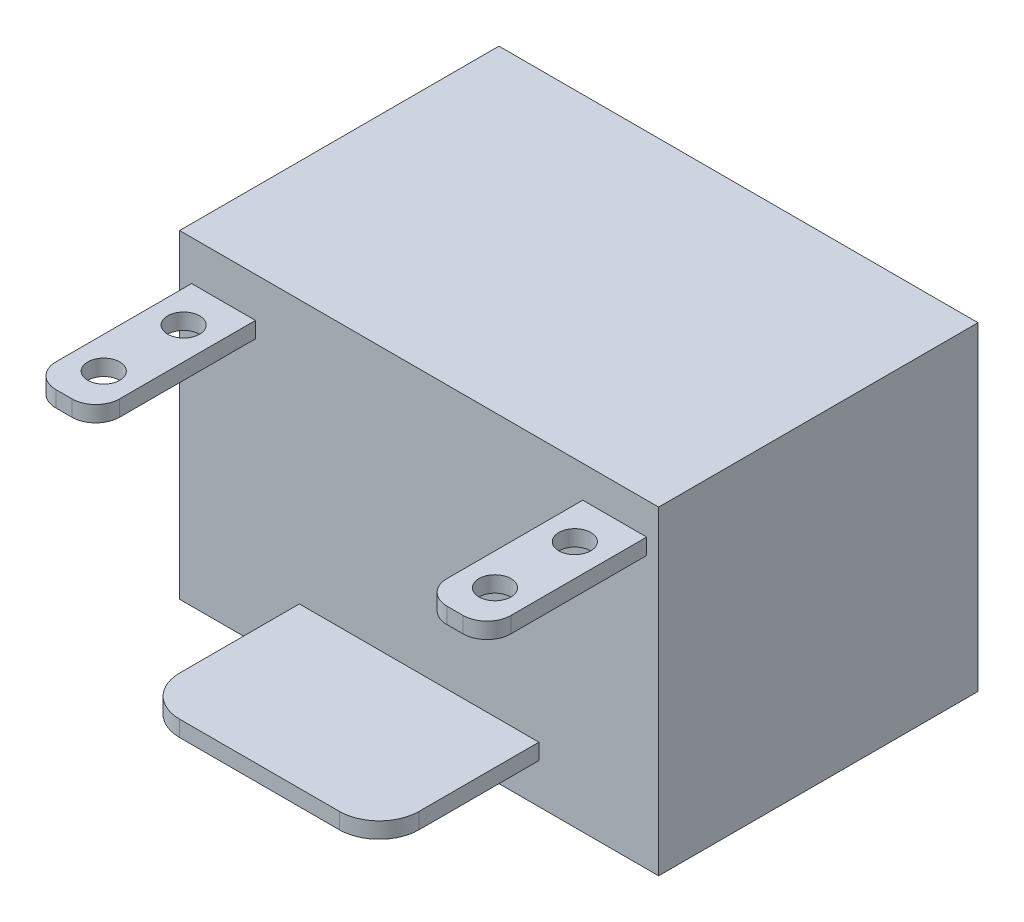
ISO-10303-21;
HEADER;
FILE_DESCRIPTION(('STEP AP214'),'2;1');
FILE_NAME('part.step','',(''),(''),'','','');
FILE_SCHEMA(('AUTOMOTIVE_DESIGN { 1 0 10303 214 1 1 1 1 }'));
ENDSEC;
DATA;
#1=APPLICATION_CONTEXT('core data for automotive mechanical design processes');
#2=APPLICATION_PROTOCOL_DEFINITION('international standard','automotive_design',2000,#1);
#3=PRODUCT_CONTEXT('',#1,'mechanical');
#4=PRODUCT('Part','Part','',(#3));
#5=PRODUCT_RELATED_PRODUCT_CATEGORY('part','',(#4));
#6=PRODUCT_DEFINITION_FORMATION('','',#4);
#7=PRODUCT_DEFINITION_CONTEXT('part definition',#1,'design');
#8=PRODUCT_DEFINITION('design','',#6,#7);
#9=PRODUCT_DEFINITION_SHAPE('','',#8);
#10=(LENGTH_UNIT() NAMED_UNIT(*) SI_UNIT(.MILLI.,.METRE.));
#11=(NAMED_UNIT(*) PLANE_ANGLE_UNIT() SI_UNIT($,.RADIAN.));
#12=(NAMED_UNIT(*) SI_UNIT($,.STERADIAN.) SOLID_ANGLE_UNIT());
#13=UNCERTAINTY_MEASURE_WITH_UNIT(LENGTH_MEASURE(1.E-05),#10,'distance_accuracy_value','');
#14=(GEOMETRIC_REPRESENTATION_CONTEXT(3) GLOBAL_UNCERTAINTY_ASSIGNED_CONTEXT((#13)) GLOBAL_UNIT_ASSIGNED_CONTEXT((#10,
#11,#12)) REPRESENTATION_CONTEXT('',''));
#15=CARTESIAN_POINT('',(0.,0.,0.));
#16=DIRECTION('',(0.,0.,1.));
#17=DIRECTION('',(1.,0.,0.));
#18=AXIS2_PLACEMENT_3D('',#15,#16,#17);
#19=CARTESIAN_POINT('',(0.,-15.,20.));
#20=DIRECTION('',(0.,1.,0.));
#21=DIRECTION('',(0.,0.,1.));
#22=AXIS2_PLACEMENT_3D('',#19,#20,#21);
#23=PLANE('',#22);
#24=CARTESIAN_POINT('',(-10.,-15.,15.));
#25=DIRECTION('',(0.,-1.,0.));
#26=DIRECTION('',(0.,0.,-1.));
#27=AXIS2_PLACEMENT_3D('',#24,#25,#26);
#28=CIRCLE('',#27,5.);
#29=CARTESIAN_POINT('',(-9.99999999999998,-15.,20.));
#30=VERTEX_POINT('',#29);
#31=CARTESIAN_POINT('',(-15.,-15.,15.));
#32=VERTEX_POINT('',#31);
#33=EDGE_CURVE('E113',#30,#32,#28,.T.);
#34=ORIENTED_EDGE('',*,*,#33,.T.);
#35=DIRECTION('',(0.,0.,-1.));
#36=VECTOR('',#35,1.);
#37=CARTESIAN_POINT('',(-15.,-15.,20.));
#38=LINE('',#37,#36);
#39=CARTESIAN_POINT('',(-15.,-15.,0.));
#40=VERTEX_POINT('',#39);
#41=EDGE_CURVE('E248',#32,#40,#38,.T.);
#42=ORIENTED_EDGE('',*,*,#41,.T.);
#43=DIRECTION('',(1.,0.,0.));
#44=VECTOR('',#43,1.);
#45=CARTESIAN_POINT('',(0.,-15.,0.));
#46=LINE('',#45,#44);
#47=CARTESIAN_POINT('',(15.,-15.,0.));
#48=VERTEX_POINT('',#47);
#49=EDGE_CURVE('E432',#40,#48,#46,.T.);
#50=ORIENTED_EDGE('',*,*,#49,.T.);
#51=DIRECTION('',(0.,0.,-1.));
#52=VECTOR('',#51,1.);
#53=CARTESIAN_POINT('',(15.,-15.,20.));
#54=LINE('',#53,#52);
#55=CARTESIAN_POINT('',(15.,-15.,15.));
#56=VERTEX_POINT('',#55);
#57=EDGE_CURVE('E275',#56,#48,#54,.T.);
#58=ORIENTED_EDGE('',*,*,#57,.F.);
#59=CARTESIAN_POINT('',(9.99999999999999,-15.,15.));
#60=DIRECTION('',(0.,-1.,0.));
#61=DIRECTION('',(0.,0.,-1.));
#62=AXIS2_PLACEMENT_3D('',#59,#60,#61);
#63=CIRCLE('',#62,5.);
#64=CARTESIAN_POINT('',(9.99999999999995,-15.,20.));
#65=VERTEX_POINT('',#64);
#66=EDGE_CURVE('E417',#56,#65,#63,.T.);
#67=ORIENTED_EDGE('',*,*,#66,.T.);
#68=DIRECTION('',(1.,0.,0.));
#69=VECTOR('',#68,1.);
#70=CARTESIAN_POINT('',(0.,-15.,20.));
#71=LINE('',#70,#69);
#72=EDGE_CURVE('E252',#30,#65,#71,.T.);
#73=ORIENTED_EDGE('',*,*,#72,.F.);
#74=EDGE_LOOP('',(#34,#42,#50,#58,#67,#73));
#75=FACE_BOUND('',#74,.T.);
#76=ADVANCED_FACE('F89',(#75),#23,.F.);
#77=CARTESIAN_POINT('',(0.,-13.,20.));
#78=DIRECTION('',(0.,1.,0.));
#79=DIRECTION('',(0.,0.,1.));
#80=AXIS2_PLACEMENT_3D('',#77,#78,#79);
#81=PLANE('',#80);
#82=DIRECTION('',(0.,0.,-1.));
#83=VECTOR('',#82,1.);
#84=CARTESIAN_POINT('',(-15.,-13.,20.));
#85=LINE('',#84,#83);
#86=CARTESIAN_POINT('',(-15.,-13.,15.));
#87=VERTEX_POINT('',#86);
#88=CARTESIAN_POINT('',(-15.,-13.,0.));
#89=VERTEX_POINT('',#88);
#90=EDGE_CURVE('E261',#87,#89,#85,.T.);
#91=ORIENTED_EDGE('',*,*,#90,.F.);
#92=CARTESIAN_POINT('',(-10.,-13.,15.));
#93=DIRECTION('',(0.,1.,0.));
#94=DIRECTION('',(0.,0.,1.));
#95=AXIS2_PLACEMENT_3D('',#92,#93,#94);
#96=CIRCLE('',#95,5.);
#97=CARTESIAN_POINT('',(-9.99999999999998,-13.,20.));
#98=VERTEX_POINT('',#97);
#99=EDGE_CURVE('E239',#87,#98,#96,.T.);
#100=ORIENTED_EDGE('',*,*,#99,.T.);
#101=DIRECTION('',(1.,0.,0.));
#102=VECTOR('',#101,1.);
#103=CARTESIAN_POINT('',(0.,-13.,20.));
#104=LINE('',#103,#102);
#105=CARTESIAN_POINT('',(9.99999999999999,-13.,20.));
#106=VERTEX_POINT('',#105);
#107=EDGE_CURVE('E262',#98,#106,#104,.T.);
#108=ORIENTED_EDGE('',*,*,#107,.T.);
#109=CARTESIAN_POINT('',(9.99999999999999,-13.,15.));
#110=DIRECTION('',(0.,1.,0.));
#111=DIRECTION('',(0.,0.,1.));
#112=AXIS2_PLACEMENT_3D('',#109,#110,#111);
#113=CIRCLE('',#112,5.);
#114=CARTESIAN_POINT('',(15.,-13.,15.));
#115=VERTEX_POINT('',#114);
#116=EDGE_CURVE('E105',#106,#115,#113,.T.);
#117=ORIENTED_EDGE('',*,*,#116,.T.);
#118=DIRECTION('',(0.,0.,-1.));
#119=VECTOR('',#118,1.);
#120=CARTESIAN_POINT('',(15.,-13.,20.));
#121=LINE('',#120,#119);
#122=CARTESIAN_POINT('',(15.,-13.,0.));
#123=VERTEX_POINT('',#122);
#124=EDGE_CURVE('E266',#115,#123,#121,.T.);
#125=ORIENTED_EDGE('',*,*,#124,.T.);
#126=DIRECTION('',(1.,0.,0.));
#127=VECTOR('',#126,1.);
#128=CARTESIAN_POINT('',(0.,-13.,0.));
#129=LINE('',#128,#127);
#130=EDGE_CURVE('E428',#89,#123,#129,.T.);
#131=ORIENTED_EDGE('',*,*,#130,.F.);
#132=EDGE_LOOP('',(#91,#100,#108,#117,#125,#131));
#133=FACE_BOUND('',#132,.T.);
#134=ADVANCED_FACE('F536',(#133),#81,.T.);
#135=CARTESIAN_POINT('',(0.,0.,20.));
#136=DIRECTION('',(0.,0.,1.));
#137=DIRECTION('',(1.,0.,0.));
#138=AXIS2_PLACEMENT_3D('',#135,#136,#137);
#139=PLANE('',#138);
#140=ORIENTED_EDGE('',*,*,#107,.F.);
#141=DIRECTION('',(0.,-1.,0.));
#142=VECTOR('',#141,1.);
#143=CARTESIAN_POINT('',(-10.,5.,20.));
#144=LINE('',#143,#142);
#145=EDGE_CURVE('E12',#98,#30,#144,.T.);
#146=ORIENTED_EDGE('',*,*,#145,.T.);
#147=ORIENTED_EDGE('',*,*,#72,.T.);
#148=DIRECTION('',(0.,-1.,0.));
#149=VECTOR('',#148,1.);
#150=CARTESIAN_POINT('',(9.99999999999999,5.,20.));
#151=LINE('',#150,#149);
#152=EDGE_CURVE('E98',#106,#65,#151,.T.);
#153=ORIENTED_EDGE('',*,*,#152,.F.);
#154=EDGE_LOOP('',(#140,#146,#147,#153));
#155=FACE_BOUND('',#154,.T.);
#156=ADVANCED_FACE('F424',(#155),#139,.T.);
#157=CARTESIAN_POINT('',(0.,0.,20.));
#158=DIRECTION('',(0.,0.,1.));
#159=DIRECTION('',(1.,0.,0.));
#160=AXIS2_PLACEMENT_3D('',#157,#158,#159);
#161=PLANE('',#160);
#162=DIRECTION('',(0.,1.,0.));
#163=VECTOR('',#162,1.);
#164=CARTESIAN_POINT('',(-23.5,-20.,20.));
#165=LINE('',#164,#163);
#166=CARTESIAN_POINT('',(-23.5,15.,20.));
#167=VERTEX_POINT('',#166);
#168=CARTESIAN_POINT('',(-23.5,13.,20.));
#169=VERTEX_POINT('',#168);
#170=EDGE_CURVE('E402',#167,#169,#165,.F.);
#171=ORIENTED_EDGE('',*,*,#170,.F.);
#172=DIRECTION('',(1.,0.,0.));
#173=VECTOR('',#172,1.);
#174=CARTESIAN_POINT('',(0.,15.,20.));
#175=LINE('',#174,#173);
#176=CARTESIAN_POINT('',(-25.5,15.,20.));
#177=VERTEX_POINT('',#176);
#178=EDGE_CURVE('E319',#177,#167,#175,.T.);
#179=ORIENTED_EDGE('',*,*,#178,.F.);
#180=DIRECTION('',(0.,1.,0.));
#181=VECTOR('',#180,1.);
#182=CARTESIAN_POINT('',(-25.5,-20.,20.));
#183=LINE('',#182,#181);
#184=CARTESIAN_POINT('',(-25.5,13.,20.));
#185=VERTEX_POINT('',#184);
#186=EDGE_CURVE('E398',#177,#185,#183,.F.);
#187=ORIENTED_EDGE('',*,*,#186,.T.);
#188=DIRECTION('',(1.,0.,0.));
#189=VECTOR('',#188,1.);
#190=CARTESIAN_POINT('',(0.,13.,20.));
#191=LINE('',#190,#189);
#192=EDGE_CURVE('E315',#185,#169,#191,.T.);
#193=ORIENTED_EDGE('',*,*,#192,.T.);
#194=EDGE_LOOP('',(#171,#179,#187,#193));
#195=FACE_BOUND('',#194,.T.);
#196=ADVANCED_FACE('F564',(#195),#161,.T.);
#197=CARTESIAN_POINT('',(0.,14.,20.));
#198=DIRECTION('',(0.,1.,0.));
#199=DIRECTION('',(0.,0.,1.));
#200=AXIS2_PLACEMENT_3D('',#197,#198,#199);
#201=PLANE('',#200);
#202=CARTESIAN_POINT('',(24.5,14.,15.));
#203=DIRECTION('',(0.,1.,0.));
#204=DIRECTION('',(0.,0.,1.));
#205=AXIS2_PLACEMENT_3D('',#202,#203,#204);
#206=CIRCLE('',#205,2.);
#207=CARTESIAN_POINT('',(24.5,14.,17.));
#208=VERTEX_POINT('',#207);
#209=EDGE_CURVE('E491',#208,#208,#206,.T.);
#210=ORIENTED_EDGE('',*,*,#209,.T.);
#211=EDGE_LOOP('',(#210));
#212=FACE_BOUND('',#211,.T.);
#213=CARTESIAN_POINT('',(23.5,14.,17.));
#214=DIRECTION('',(0.,1.,0.));
#215=DIRECTION('',(0.,0.,1.));
#216=AXIS2_PLACEMENT_3D('',#213,#214,#215);
#217=CIRCLE('',#216,3.);
#218=CARTESIAN_POINT('',(20.5,14.,17.));
#219=VERTEX_POINT('',#218);
#220=CARTESIAN_POINT('',(23.5,14.,20.));
#221=VERTEX_POINT('',#220);
#222=EDGE_CURVE('E488',#219,#221,#217,.T.);
#223=ORIENTED_EDGE('',*,*,#222,.F.);
#224=DIRECTION('',(0.,0.,-1.));
#225=VECTOR('',#224,1.);
#226=CARTESIAN_POINT('',(20.5,14.,20.));
#227=LINE('',#226,#225);
#228=CARTESIAN_POINT('',(20.5,14.,0.));
#229=VERTEX_POINT('',#228);
#230=EDGE_CURVE('E288',#219,#229,#227,.T.);
#231=ORIENTED_EDGE('',*,*,#230,.T.);
#232=DIRECTION('',(1.,0.,0.));
#233=VECTOR('',#232,1.);
#234=CARTESIAN_POINT('',(0.,14.,0.));
#235=LINE('',#234,#233);
#236=CARTESIAN_POINT('',(28.5,14.,0.));
#237=VERTEX_POINT('',#236);
#238=EDGE_CURVE('E278',#229,#237,#235,.T.);
#239=ORIENTED_EDGE('',*,*,#238,.T.);
#240=DIRECTION('',(0.,0.,-1.));
#241=VECTOR('',#240,1.);
#242=CARTESIAN_POINT('',(28.5,14.,20.));
#243=LINE('',#242,#241);
#244=CARTESIAN_POINT('',(28.5,14.,17.));
#245=VERTEX_POINT('',#244);
#246=EDGE_CURVE('E311',#245,#237,#243,.T.);
#247=ORIENTED_EDGE('',*,*,#246,.F.);
#248=CARTESIAN_POINT('',(25.5,14.,17.));
#249=DIRECTION('',(0.,1.,0.));
#250=DIRECTION('',(0.,0.,1.));
#251=AXIS2_PLACEMENT_3D('',#248,#249,#250);
#252=CIRCLE('',#251,3.);
#253=CARTESIAN_POINT('',(25.5,14.,20.));
#254=VERTEX_POINT('',#253);
#255=EDGE_CURVE('E473',#245,#254,#252,.F.);
#256=ORIENTED_EDGE('',*,*,#255,.T.);
#257=DIRECTION('',(1.,0.,0.));
#258=VECTOR('',#257,1.);
#259=CARTESIAN_POINT('',(0.,14.,20.));
#260=LINE('',#259,#258);
#261=EDGE_CURVE('E279',#221,#254,#260,.T.);
#262=ORIENTED_EDGE('',*,*,#261,.F.);
#263=EDGE_LOOP('',(#223,#231,#239,#247,#256,#262));
#264=FACE_BOUND('',#263,.T.);
#265=CARTESIAN_POINT('',(24.5,14.,5.));
#266=DIRECTION('',(0.,1.,0.));
#267=DIRECTION('',(0.,0.,1.));
#268=AXIS2_PLACEMENT_3D('',#265,#266,#267);
#269=CIRCLE('',#268,2.);
#270=CARTESIAN_POINT('',(24.5,14.,7.));
#271=VERTEX_POINT('',#270);
#272=EDGE_CURVE('E495',#271,#271,#269,.T.);
#273=ORIENTED_EDGE('',*,*,#272,.T.);
#274=EDGE_LOOP('',(#273));
#275=FACE_BOUND('',#274,.T.);
#276=ADVANCED_FACE('F556',(#212,#264,#275),#201,.F.);
#277=CARTESIAN_POINT('',(0.,16.,20.));
#278=DIRECTION('',(0.,1.,0.));
#279=DIRECTION('',(0.,0.,1.));
#280=AXIS2_PLACEMENT_3D('',#277,#278,#279);
#281=PLANE('',#280);
#282=DIRECTION('',(0.,0.,-1.));
#283=VECTOR('',#282,1.);
#284=CARTESIAN_POINT('',(20.5,16.,20.));
#285=LINE('',#284,#283);
#286=CARTESIAN_POINT('',(20.5,16.,17.));
#287=VERTEX_POINT('',#286);
#288=CARTESIAN_POINT('',(20.5,16.,0.));
#289=VERTEX_POINT('',#288);
#290=EDGE_CURVE('E305',#287,#289,#285,.T.);
#291=ORIENTED_EDGE('',*,*,#290,.F.);
#292=CARTESIAN_POINT('',(23.5,16.,17.));
#293=DIRECTION('',(0.,1.,0.));
#294=DIRECTION('',(0.,0.,1.));
#295=AXIS2_PLACEMENT_3D('',#292,#293,#294);
#296=CIRCLE('',#295,3.);
#297=CARTESIAN_POINT('',(23.5,16.,20.));
#298=VERTEX_POINT('',#297);
#299=EDGE_CURVE('E465',#287,#298,#296,.T.);
#300=ORIENTED_EDGE('',*,*,#299,.T.);
#301=DIRECTION('',(1.,0.,0.));
#302=VECTOR('',#301,1.);
#303=CARTESIAN_POINT('',(0.,16.,20.));
#304=LINE('',#303,#302);
#305=CARTESIAN_POINT('',(25.5,16.,20.));
#306=VERTEX_POINT('',#305);
#307=EDGE_CURVE('E283',#298,#306,#304,.T.);
#308=ORIENTED_EDGE('',*,*,#307,.T.);
#309=CARTESIAN_POINT('',(25.5,16.,17.));
#310=DIRECTION('',(0.,1.,0.));
#311=DIRECTION('',(0.,0.,1.));
#312=AXIS2_PLACEMENT_3D('',#309,#310,#311);
#313=CIRCLE('',#312,3.);
#314=CARTESIAN_POINT('',(28.5,16.,17.));
#315=VERTEX_POINT('',#314);
#316=EDGE_CURVE('E459',#315,#306,#313,.F.);
#317=ORIENTED_EDGE('',*,*,#316,.F.);
#318=DIRECTION('',(0.,0.,-1.));
#319=VECTOR('',#318,1.);
#320=CARTESIAN_POINT('',(28.5,16.,20.));
#321=LINE('',#320,#319);
#322=CARTESIAN_POINT('',(28.5,16.,0.));
#323=VERTEX_POINT('',#322);
#324=EDGE_CURVE('E308',#315,#323,#321,.T.);
#325=ORIENTED_EDGE('',*,*,#324,.T.);
#326=DIRECTION('',(1.,0.,0.));
#327=VECTOR('',#326,1.);
#328=CARTESIAN_POINT('',(0.,16.,0.));
#329=LINE('',#328,#327);
#330=EDGE_CURVE('E296',#289,#323,#329,.T.);
#331=ORIENTED_EDGE('',*,*,#330,.F.);
#332=EDGE_LOOP('',(#291,#300,#308,#317,#325,#331));
#333=FACE_BOUND('',#332,.T.);
#334=CARTESIAN_POINT('',(24.5,16.,15.));
#335=DIRECTION('',(0.,1.,0.));
#336=DIRECTION('',(0.,0.,1.));
#337=AXIS2_PLACEMENT_3D('',#334,#335,#336);
#338=CIRCLE('',#337,2.);
#339=CARTESIAN_POINT('',(24.5,16.,17.));
#340=VERTEX_POINT('',#339);
#341=EDGE_CURVE('E474',#340,#340,#338,.T.);
#342=ORIENTED_EDGE('',*,*,#341,.F.);
#343=EDGE_LOOP('',(#342));
#344=FACE_BOUND('',#343,.T.);
#345=CARTESIAN_POINT('',(24.5,16.,5.));
#346=DIRECTION('',(0.,1.,0.));
#347=DIRECTION('',(0.,0.,1.));
#348=AXIS2_PLACEMENT_3D('',#345,#346,#347);
#349=CIRCLE('',#348,2.);
#350=CARTESIAN_POINT('',(24.5,16.,7.));
#351=VERTEX_POINT('',#350);
#352=EDGE_CURVE('E469',#351,#351,#349,.T.);
#353=ORIENTED_EDGE('',*,*,#352,.F.);
#354=EDGE_LOOP('',(#353));
#355=FACE_BOUND('',#354,.T.);
#356=ADVANCED_FACE('F552',(#333,#344,#355),#281,.T.);
#357=CARTESIAN_POINT('',(20.5,0.,20.));
#358=DIRECTION('',(-1.,0.,0.));
#359=DIRECTION('',(0.,0.,1.));
#360=AXIS2_PLACEMENT_3D('',#357,#358,#359);
#361=PLANE('',#360);
#362=ORIENTED_EDGE('',*,*,#230,.F.);
#363=DIRECTION('',(0.,1.,0.));
#364=VECTOR('',#363,1.);
#365=CARTESIAN_POINT('',(20.5,-20.,17.));
#366=LINE('',#365,#364);
#367=EDGE_CURVE('E478',#219,#287,#366,.T.);
#368=ORIENTED_EDGE('',*,*,#367,.T.);
#369=ORIENTED_EDGE('',*,*,#290,.T.);
#370=DIRECTION('',(0.,1.,0.));
#371=VECTOR('',#370,1.);
#372=CARTESIAN_POINT('',(20.5,0.,0.));
#373=LINE('',#372,#371);
#374=EDGE_CURVE('E284',#229,#289,#373,.T.);
#375=ORIENTED_EDGE('',*,*,#374,.F.);
#376=EDGE_LOOP('',(#362,#368,#369,#375));
#377=FACE_BOUND('',#376,.T.);
#378=ADVANCED_FACE('F549',(#377),#361,.T.);
#379=CARTESIAN_POINT('',(0.,0.,0.));
#380=DIRECTION('',(0.,0.,1.));
#381=DIRECTION('',(1.,0.,0.));
#382=AXIS2_PLACEMENT_3D('',#379,#380,#381);
#383=PLANE('',#382);
#384=DIRECTION('',(1.,0.,0.));
#385=VECTOR('',#384,1.);
#386=CARTESIAN_POINT('',(0.,-20.,0.));
#387=LINE('',#386,#385);
#388=CARTESIAN_POINT('',(-30.,-20.,0.));
#389=VERTEX_POINT('',#388);
#390=CARTESIAN_POINT('',(30.,-20.,0.));
#391=VERTEX_POINT('',#390);
#392=EDGE_CURVE('E350',#389,#391,#387,.T.);
#393=ORIENTED_EDGE('',*,*,#392,.T.);
#394=DIRECTION('',(0.,1.,0.));
#395=VECTOR('',#394,1.);
#396=CARTESIAN_POINT('',(30.,0.,0.));
#397=LINE('',#396,#395);
#398=CARTESIAN_POINT('',(30.,20.,0.));
#399=VERTEX_POINT('',#398);
#400=EDGE_CURVE('E370',#391,#399,#397,.T.);
#401=ORIENTED_EDGE('',*,*,#400,.T.);
#402=DIRECTION('',(1.,0.,0.));
#403=VECTOR('',#402,1.);
#404=CARTESIAN_POINT('',(0.,20.,0.));
#405=LINE('',#404,#403);
#406=CARTESIAN_POINT('',(-30.,20.,0.));
#407=VERTEX_POINT('',#406);
#408=EDGE_CURVE('E374',#407,#399,#405,.T.);
#409=ORIENTED_EDGE('',*,*,#408,.F.);
#410=DIRECTION('',(0.,1.,0.));
#411=VECTOR('',#410,1.);
#412=CARTESIAN_POINT('',(-30.,0.,0.));
#413=LINE('',#412,#411);
#414=EDGE_CURVE('E356',#389,#407,#413,.T.);
#415=ORIENTED_EDGE('',*,*,#414,.F.);
#416=EDGE_LOOP('',(#393,#401,#409,#415));
#417=FACE_BOUND('',#416,.T.);
#418=DIRECTION('',(0.,1.,0.));
#419=VECTOR('',#418,1.);
#420=CARTESIAN_POINT('',(-20.5,0.,0.));
#421=LINE('',#420,#419);
#422=CARTESIAN_POINT('',(-20.5,13.,0.));
#423=VERTEX_POINT('',#422);
#424=CARTESIAN_POINT('',(-20.5,15.,0.));
#425=VERTEX_POINT('',#424);
#426=EDGE_CURVE('E328',#423,#425,#421,.T.);
#427=ORIENTED_EDGE('',*,*,#426,.F.);
#428=DIRECTION('',(1.,0.,0.));
#429=VECTOR('',#428,1.);
#430=CARTESIAN_POINT('',(0.,13.,0.));
#431=LINE('',#430,#429);
#432=CARTESIAN_POINT('',(-28.5,13.,0.));
#433=VERTEX_POINT('',#432);
#434=EDGE_CURVE('E314',#433,#423,#431,.T.);
#435=ORIENTED_EDGE('',*,*,#434,.F.);
#436=DIRECTION('',(0.,1.,0.));
#437=VECTOR('',#436,1.);
#438=CARTESIAN_POINT('',(-28.5,0.,0.));
#439=LINE('',#438,#437);
#440=CARTESIAN_POINT('',(-28.5,15.,0.));
#441=VERTEX_POINT('',#440);
#442=EDGE_CURVE('E320',#433,#441,#439,.T.);
#443=ORIENTED_EDGE('',*,*,#442,.T.);
#444=DIRECTION('',(1.,0.,0.));
#445=VECTOR('',#444,1.);
#446=CARTESIAN_POINT('',(0.,15.,0.));
#447=LINE('',#446,#445);
#448=EDGE_CURVE('E332',#441,#425,#447,.T.);
#449=ORIENTED_EDGE('',*,*,#448,.T.);
#450=EDGE_LOOP('',(#427,#435,#443,#449));
#451=FACE_BOUND('',#450,.T.);
#452=DIRECTION('',(0.,1.,0.));
#453=VECTOR('',#452,1.);
#454=CARTESIAN_POINT('',(28.5,0.,0.));
#455=LINE('',#454,#453);
#456=EDGE_CURVE('E292',#237,#323,#455,.T.);
#457=ORIENTED_EDGE('',*,*,#456,.F.);
#458=ORIENTED_EDGE('',*,*,#238,.F.);
#459=ORIENTED_EDGE('',*,*,#374,.T.);
#460=ORIENTED_EDGE('',*,*,#330,.T.);
#461=EDGE_LOOP('',(#457,#458,#459,#460));
#462=FACE_BOUND('',#461,.T.);
#463=DIRECTION('',(0.,1.,0.));
#464=VECTOR('',#463,1.);
#465=CARTESIAN_POINT('',(15.,0.,0.));
#466=LINE('',#465,#464);
#467=EDGE_CURVE('E435',#48,#123,#466,.T.);
#468=ORIENTED_EDGE('',*,*,#467,.F.);
#469=ORIENTED_EDGE('',*,*,#49,.F.);
#470=DIRECTION('',(0.,1.,0.));
#471=VECTOR('',#470,1.);
#472=CARTESIAN_POINT('',(-15.,0.,0.));
#473=LINE('',#472,#471);
#474=EDGE_CURVE('E259',#40,#89,#473,.T.);
#475=ORIENTED_EDGE('',*,*,#474,.T.);
#476=ORIENTED_EDGE('',*,*,#130,.T.);
#477=EDGE_LOOP('',(#468,#469,#475,#476));
#478=FACE_BOUND('',#477,.T.);
#479=ADVANCED_FACE('F443',(#417,#451,#462,#478),#383,.T.);
#480=CARTESIAN_POINT('',(0.,-20.,-40.));
#481=DIRECTION('',(0.,-1.,0.));
#482=DIRECTION('',(0.,0.,-1.));
#483=AXIS2_PLACEMENT_3D('',#480,#481,#482);
#484=PLANE('',#483);
#485=ORIENTED_EDGE('',*,*,#392,.F.);
#486=DIRECTION('',(0.,0.,1.));
#487=VECTOR('',#486,1.);
#488=CARTESIAN_POINT('',(-30.,-20.,-40.));
#489=LINE('',#488,#487);
#490=CARTESIAN_POINT('',(-30.,-20.,-40.));
#491=VERTEX_POINT('',#490);
#492=EDGE_CURVE('E380',#491,#389,#489,.T.);
#493=ORIENTED_EDGE('',*,*,#492,.F.);
#494=DIRECTION('',(1.,0.,0.));
#495=VECTOR('',#494,1.);
#496=CARTESIAN_POINT('',(0.,-20.,-40.));
#497=LINE('',#496,#495);
#498=CARTESIAN_POINT('',(30.,-20.,-40.));
#499=VERTEX_POINT('',#498);
#500=EDGE_CURVE('E351',#491,#499,#497,.T.);
#501=ORIENTED_EDGE('',*,*,#500,.T.);
#502=DIRECTION('',(0.,0.,1.));
#503=VECTOR('',#502,1.);
#504=CARTESIAN_POINT('',(30.,-20.,-40.));
#505=LINE('',#504,#503);
#506=EDGE_CURVE('E366',#499,#391,#505,.T.);
#507=ORIENTED_EDGE('',*,*,#506,.T.);
#508=EDGE_LOOP('',(#485,#493,#501,#507));
#509=FACE_BOUND('',#508,.T.);
#510=ADVANCED_FACE('F91',(#509),#484,.T.);
#511=CARTESIAN_POINT('',(-30.,0.,-40.));
#512=DIRECTION('',(1.,0.,0.));
#513=DIRECTION('',(0.,0.,-1.));
#514=AXIS2_PLACEMENT_3D('',#511,#512,#513);
#515=PLANE('',#514);
#516=ORIENTED_EDGE('',*,*,#414,.T.);
#517=DIRECTION('',(0.,0.,1.));
#518=VECTOR('',#517,1.);
#519=CARTESIAN_POINT('',(-30.,20.,-40.));
#520=LINE('',#519,#518);
#521=CARTESIAN_POINT('',(-30.,20.,-40.));
#522=VERTEX_POINT('',#521);
#523=EDGE_CURVE('E384',#522,#407,#520,.T.);
#524=ORIENTED_EDGE('',*,*,#523,.F.);
#525=DIRECTION('',(0.,1.,0.));
#526=VECTOR('',#525,1.);
#527=CARTESIAN_POINT('',(-30.,0.,-40.));
#528=LINE('',#527,#526);
#529=EDGE_CURVE('E363',#491,#522,#528,.T.);
#530=ORIENTED_EDGE('',*,*,#529,.F.);
#531=ORIENTED_EDGE('',*,*,#492,.T.);
#532=EDGE_LOOP('',(#516,#524,#530,#531));
#533=FACE_BOUND('',#532,.T.);
#534=ADVANCED_FACE('F591',(#533),#515,.F.);
#535=CARTESIAN_POINT('',(0.,20.,-40.));
#536=DIRECTION('',(0.,-1.,0.));
#537=DIRECTION('',(0.,0.,-1.));
#538=AXIS2_PLACEMENT_3D('',#535,#536,#537);
#539=PLANE('',#538);
#540=ORIENTED_EDGE('',*,*,#408,.T.);
#541=DIRECTION('',(0.,0.,1.));
#542=VECTOR('',#541,1.);
#543=CARTESIAN_POINT('',(30.,20.,-40.));
#544=LINE('',#543,#542);
#545=CARTESIAN_POINT('',(30.,20.,-40.));
#546=VERTEX_POINT('',#545);
#547=EDGE_CURVE('E388',#546,#399,#544,.T.);
#548=ORIENTED_EDGE('',*,*,#547,.F.);
#549=DIRECTION('',(1.,0.,0.));
#550=VECTOR('',#549,1.);
#551=CARTESIAN_POINT('',(0.,20.,-40.));
#552=LINE('',#551,#550);
#553=EDGE_CURVE('E360',#522,#546,#552,.T.);
#554=ORIENTED_EDGE('',*,*,#553,.F.);
#555=ORIENTED_EDGE('',*,*,#523,.T.);
#556=EDGE_LOOP('',(#540,#548,#554,#555));
#557=FACE_BOUND('',#556,.T.);
#558=ADVANCED_FACE('F594',(#557),#539,.F.);
#559=CARTESIAN_POINT('',(30.,0.,-40.));
#560=DIRECTION('',(1.,0.,0.));
#561=DIRECTION('',(0.,0.,-1.));
#562=AXIS2_PLACEMENT_3D('',#559,#560,#561);
#563=PLANE('',#562);
#564=ORIENTED_EDGE('',*,*,#400,.F.);
#565=ORIENTED_EDGE('',*,*,#506,.F.);
#566=DIRECTION('',(0.,1.,0.));
#567=VECTOR('',#566,1.);
#568=CARTESIAN_POINT('',(30.,0.,-40.));
#569=LINE('',#568,#567);
#570=EDGE_CURVE('E355',#499,#546,#569,.T.);
#571=ORIENTED_EDGE('',*,*,#570,.T.);
#572=ORIENTED_EDGE('',*,*,#547,.T.);
#573=EDGE_LOOP('',(#564,#565,#571,#572));
#574=FACE_BOUND('',#573,.T.);
#575=ADVANCED_FACE('F586',(#574),#563,.T.);
#576=CARTESIAN_POINT('',(0.,0.,-40.));
#577=DIRECTION('',(0.,0.,1.));
#578=DIRECTION('',(1.,0.,0.));
#579=AXIS2_PLACEMENT_3D('',#576,#577,#578);
#580=PLANE('',#579);
#581=ORIENTED_EDGE('',*,*,#500,.F.);
#582=ORIENTED_EDGE('',*,*,#529,.T.);
#583=ORIENTED_EDGE('',*,*,#553,.T.);
#584=ORIENTED_EDGE('',*,*,#570,.F.);
#585=EDGE_LOOP('',(#581,#582,#583,#584));
#586=FACE_BOUND('',#585,.T.);
#587=ADVANCED_FACE('F582',(#586),#580,.F.);
#588=CARTESIAN_POINT('',(0.,13.,20.));
#589=DIRECTION('',(0.,1.,0.));
#590=DIRECTION('',(0.,0.,1.));
#591=AXIS2_PLACEMENT_3D('',#588,#589,#590);
#592=PLANE('',#591);
#593=CARTESIAN_POINT('',(-24.5,13.,5.));
#594=DIRECTION('',(0.,1.,0.));
#595=DIRECTION('',(0.,0.,1.));
#596=AXIS2_PLACEMENT_3D('',#593,#594,#595);
#597=CIRCLE('',#596,2.);
#598=CARTESIAN_POINT('',(-24.5,13.,7.));
#599=VERTEX_POINT('',#598);
#600=EDGE_CURVE('E414',#599,#599,#597,.T.);
#601=ORIENTED_EDGE('',*,*,#600,.T.);
#602=EDGE_LOOP('',(#601));
#603=FACE_BOUND('',#602,.T.);
#604=CARTESIAN_POINT('',(-24.5,13.,15.));
#605=DIRECTION('',(0.,1.,0.));
#606=DIRECTION('',(0.,0.,1.));
#607=AXIS2_PLACEMENT_3D('',#604,#605,#606);
#608=CIRCLE('',#607,2.);
#609=CARTESIAN_POINT('',(-24.5,13.,17.));
#610=VERTEX_POINT('',#609);
#611=EDGE_CURVE('E409',#610,#610,#608,.T.);
#612=ORIENTED_EDGE('',*,*,#611,.T.);
#613=EDGE_LOOP('',(#612));
#614=FACE_BOUND('',#613,.T.);
#615=DIRECTION('',(0.,0.,-1.));
#616=VECTOR('',#615,1.);
#617=CARTESIAN_POINT('',(-20.5,13.,20.));
#618=LINE('',#617,#616);
#619=CARTESIAN_POINT('',(-20.5,13.,17.));
#620=VERTEX_POINT('',#619);
#621=EDGE_CURVE('E347',#620,#423,#618,.T.);
#622=ORIENTED_EDGE('',*,*,#621,.F.);
#623=CARTESIAN_POINT('',(-23.5,13.,17.));
#624=DIRECTION('',(0.,1.,0.));
#625=DIRECTION('',(0.,0.,1.));
#626=AXIS2_PLACEMENT_3D('',#623,#624,#625);
#627=CIRCLE('',#626,3.);
#628=EDGE_CURVE('E410',#620,#169,#627,.F.);
#629=ORIENTED_EDGE('',*,*,#628,.T.);
#630=ORIENTED_EDGE('',*,*,#192,.F.);
#631=CARTESIAN_POINT('',(-25.5,13.,17.));
#632=DIRECTION('',(0.,1.,0.));
#633=DIRECTION('',(0.,0.,1.));
#634=AXIS2_PLACEMENT_3D('',#631,#632,#633);
#635=CIRCLE('',#634,3.);
#636=CARTESIAN_POINT('',(-28.5,13.,17.));
#637=VERTEX_POINT('',#636);
#638=EDGE_CURVE('E502',#185,#637,#635,.F.);
#639=ORIENTED_EDGE('',*,*,#638,.T.);
#640=DIRECTION('',(0.,0.,-1.));
#641=VECTOR('',#640,1.);
#642=CARTESIAN_POINT('',(-28.5,13.,20.));
#643=LINE('',#642,#641);
#644=EDGE_CURVE('E324',#637,#433,#643,.T.);
#645=ORIENTED_EDGE('',*,*,#644,.T.);
#646=ORIENTED_EDGE('',*,*,#434,.T.);
#647=EDGE_LOOP('',(#622,#629,#630,#639,#645,#646));
#648=FACE_BOUND('',#647,.T.);
#649=ADVANCED_FACE('F515',(#603,#614,#648),#592,.F.);
#650=CARTESIAN_POINT('',(-20.5,0.,20.));
#651=DIRECTION('',(-1.,0.,0.));
#652=DIRECTION('',(0.,0.,1.));
#653=AXIS2_PLACEMENT_3D('',#650,#651,#652);
#654=PLANE('',#653);
#655=DIRECTION('',(0.,0.,-1.));
#656=VECTOR('',#655,1.);
#657=CARTESIAN_POINT('',(-20.5,15.,20.));
#658=LINE('',#657,#656);
#659=CARTESIAN_POINT('',(-20.5,15.,17.));
#660=VERTEX_POINT('',#659);
#661=EDGE_CURVE('E344',#660,#425,#658,.T.);
#662=ORIENTED_EDGE('',*,*,#661,.F.);
#663=DIRECTION('',(0.,1.,0.));
#664=VECTOR('',#663,1.);
#665=CARTESIAN_POINT('',(-20.5,-20.,17.));
#666=LINE('',#665,#664);
#667=EDGE_CURVE('E455',#620,#660,#666,.T.);
#668=ORIENTED_EDGE('',*,*,#667,.F.);
#669=ORIENTED_EDGE('',*,*,#621,.T.);
#670=ORIENTED_EDGE('',*,*,#426,.T.);
#671=EDGE_LOOP('',(#662,#668,#669,#670));
#672=FACE_BOUND('',#671,.T.);
#673=ADVANCED_FACE('F575',(#672),#654,.F.);
#674=CARTESIAN_POINT('',(0.,15.,20.));
#675=DIRECTION('',(0.,1.,0.));
#676=DIRECTION('',(0.,0.,1.));
#677=AXIS2_PLACEMENT_3D('',#674,#675,#676);
#678=PLANE('',#677);
#679=CARTESIAN_POINT('',(-24.5,15.,5.));
#680=DIRECTION('',(0.,1.,0.));
#681=DIRECTION('',(0.,0.,1.));
#682=AXIS2_PLACEMENT_3D('',#679,#680,#681);
#683=CIRCLE('',#682,2.);
#684=CARTESIAN_POINT('',(-24.5,15.,7.));
#685=VERTEX_POINT('',#684);
#686=EDGE_CURVE('E411',#685,#685,#683,.T.);
#687=ORIENTED_EDGE('',*,*,#686,.F.);
#688=EDGE_LOOP('',(#687));
#689=FACE_BOUND('',#688,.T.);
#690=CARTESIAN_POINT('',(-23.5,15.,17.));
#691=DIRECTION('',(0.,1.,0.));
#692=DIRECTION('',(0.,0.,1.));
#693=AXIS2_PLACEMENT_3D('',#690,#691,#692);
#694=CIRCLE('',#693,3.);
#695=EDGE_CURVE('E506',#660,#167,#694,.F.);
#696=ORIENTED_EDGE('',*,*,#695,.F.);
#697=ORIENTED_EDGE('',*,*,#661,.T.);
#698=ORIENTED_EDGE('',*,*,#448,.F.);
#699=DIRECTION('',(0.,0.,-1.));
#700=VECTOR('',#699,1.);
#701=CARTESIAN_POINT('',(-28.5,15.,20.));
#702=LINE('',#701,#700);
#703=CARTESIAN_POINT('',(-28.5,15.,17.));
#704=VERTEX_POINT('',#703);
#705=EDGE_CURVE('E341',#704,#441,#702,.T.);
#706=ORIENTED_EDGE('',*,*,#705,.F.);
#707=CARTESIAN_POINT('',(-25.5,15.,17.));
#708=DIRECTION('',(0.,1.,0.));
#709=DIRECTION('',(0.,0.,1.));
#710=AXIS2_PLACEMENT_3D('',#707,#708,#709);
#711=CIRCLE('',#710,3.);
#712=EDGE_CURVE('E499',#177,#704,#711,.F.);
#713=ORIENTED_EDGE('',*,*,#712,.F.);
#714=ORIENTED_EDGE('',*,*,#178,.T.);
#715=EDGE_LOOP('',(#696,#697,#698,#706,#713,#714));
#716=FACE_BOUND('',#715,.T.);
#717=CARTESIAN_POINT('',(-24.5,15.,15.));
#718=DIRECTION('',(0.,1.,0.));
#719=DIRECTION('',(0.,0.,1.));
#720=AXIS2_PLACEMENT_3D('',#717,#718,#719);
#721=CIRCLE('',#720,2.);
#722=CARTESIAN_POINT('',(-24.5,15.,17.));
#723=VERTEX_POINT('',#722);
#724=EDGE_CURVE('E405',#723,#723,#721,.T.);
#725=ORIENTED_EDGE('',*,*,#724,.F.);
#726=EDGE_LOOP('',(#725));
#727=FACE_BOUND('',#726,.T.);
#728=ADVANCED_FACE('F571',(#689,#716,#727),#678,.T.);
#729=CARTESIAN_POINT('',(-28.5,0.,20.));
#730=DIRECTION('',(-1.,0.,0.));
#731=DIRECTION('',(0.,-1.,0.));
#732=AXIS2_PLACEMENT_3D('',#729,#730,#731);
#733=PLANE('',#732);
#734=DIRECTION('',(0.,1.,0.));
#735=VECTOR('',#734,1.);
#736=CARTESIAN_POINT('',(-28.5,-20.,17.));
#737=LINE('',#736,#735);
#738=EDGE_CURVE('E458',#637,#704,#737,.T.);
#739=ORIENTED_EDGE('',*,*,#738,.T.);
#740=ORIENTED_EDGE('',*,*,#705,.T.);
#741=ORIENTED_EDGE('',*,*,#442,.F.);
#742=ORIENTED_EDGE('',*,*,#644,.F.);
#743=EDGE_LOOP('',(#739,#740,#741,#742));
#744=FACE_BOUND('',#743,.T.);
#745=ADVANCED_FACE('F560',(#744),#733,.T.);
#746=CARTESIAN_POINT('',(28.5,0.,20.));
#747=DIRECTION('',(-1.,0.,0.));
#748=DIRECTION('',(0.,0.,1.));
#749=AXIS2_PLACEMENT_3D('',#746,#747,#748);
#750=PLANE('',#749);
#751=ORIENTED_EDGE('',*,*,#324,.F.);
#752=DIRECTION('',(0.,1.,0.));
#753=VECTOR('',#752,1.);
#754=CARTESIAN_POINT('',(28.5,-20.,17.));
#755=LINE('',#754,#753);
#756=EDGE_CURVE('E462',#245,#315,#755,.T.);
#757=ORIENTED_EDGE('',*,*,#756,.F.);
#758=ORIENTED_EDGE('',*,*,#246,.T.);
#759=ORIENTED_EDGE('',*,*,#456,.T.);
#760=EDGE_LOOP('',(#751,#757,#758,#759));
#761=FACE_BOUND('',#760,.T.);
#762=ADVANCED_FACE('F547',(#761),#750,.F.);
#763=CARTESIAN_POINT('',(0.,0.,20.));
#764=DIRECTION('',(0.,0.,1.));
#765=DIRECTION('',(1.,0.,0.));
#766=AXIS2_PLACEMENT_3D('',#763,#764,#765);
#767=PLANE('',#766);
#768=DIRECTION('',(0.,1.,0.));
#769=VECTOR('',#768,1.);
#770=CARTESIAN_POINT('',(23.5,-20.,20.));
#771=LINE('',#770,#769);
#772=EDGE_CURVE('E395',#221,#298,#771,.T.);
#773=ORIENTED_EDGE('',*,*,#772,.F.);
#774=ORIENTED_EDGE('',*,*,#261,.T.);
#775=DIRECTION('',(0.,1.,0.));
#776=VECTOR('',#775,1.);
#777=CARTESIAN_POINT('',(25.5,-20.,20.));
#778=LINE('',#777,#776);
#779=EDGE_CURVE('E383',#306,#254,#778,.F.);
#780=ORIENTED_EDGE('',*,*,#779,.F.);
#781=ORIENTED_EDGE('',*,*,#307,.F.);
#782=EDGE_LOOP('',(#773,#774,#780,#781));
#783=FACE_BOUND('',#782,.T.);
#784=ADVANCED_FACE('F544',(#783),#767,.T.);
#785=CARTESIAN_POINT('',(15.,0.,20.));
#786=DIRECTION('',(-1.,0.,0.));
#787=DIRECTION('',(0.,0.,1.));
#788=AXIS2_PLACEMENT_3D('',#785,#786,#787);
#789=PLANE('',#788);
#790=ORIENTED_EDGE('',*,*,#124,.F.);
#791=DIRECTION('',(0.,-1.,0.));
#792=VECTOR('',#791,1.);
#793=CARTESIAN_POINT('',(15.,5.,15.));
#794=LINE('',#793,#792);
#795=EDGE_CURVE('E254',#115,#56,#794,.T.);
#796=ORIENTED_EDGE('',*,*,#795,.T.);
#797=ORIENTED_EDGE('',*,*,#57,.T.);
#798=ORIENTED_EDGE('',*,*,#467,.T.);
#799=EDGE_LOOP('',(#790,#796,#797,#798));
#800=FACE_BOUND('',#799,.T.);
#801=ADVANCED_FACE('F447',(#800),#789,.F.);
#802=CARTESIAN_POINT('',(-15.,0.,20.));
#803=DIRECTION('',(-1.,0.,0.));
#804=DIRECTION('',(0.,0.,1.));
#805=AXIS2_PLACEMENT_3D('',#802,#803,#804);
#806=PLANE('',#805);
#807=DIRECTION('',(0.,-1.,0.));
#808=VECTOR('',#807,1.);
#809=CARTESIAN_POINT('',(-15.,5.,15.));
#810=LINE('',#809,#808);
#811=EDGE_CURVE('E236',#87,#32,#810,.T.);
#812=ORIENTED_EDGE('',*,*,#811,.F.);
#813=ORIENTED_EDGE('',*,*,#90,.T.);
#814=ORIENTED_EDGE('',*,*,#474,.F.);
#815=ORIENTED_EDGE('',*,*,#41,.F.);
#816=EDGE_LOOP('',(#812,#813,#814,#815));
#817=FACE_BOUND('',#816,.T.);
#818=ADVANCED_FACE('F257',(#817),#806,.T.);
#819=CARTESIAN_POINT('',(25.5,-20.,17.));
#820=DIRECTION('',(0.,1.,0.));
#821=DIRECTION('',(0.,0.,1.));
#822=AXIS2_PLACEMENT_3D('',#819,#820,#821);
#823=CYLINDRICAL_SURFACE('',#822,3.);
#824=ORIENTED_EDGE('',*,*,#756,.T.);
#825=ORIENTED_EDGE('',*,*,#316,.T.);
#826=ORIENTED_EDGE('',*,*,#779,.T.);
#827=ORIENTED_EDGE('',*,*,#255,.F.);
#828=EDGE_LOOP('',(#824,#825,#826,#827));
#829=FACE_BOUND('',#828,.T.);
#830=ADVANCED_FACE('F711',(#829),#823,.T.);
#831=CARTESIAN_POINT('',(23.5,-20.,17.));
#832=DIRECTION('',(0.,1.,0.));
#833=DIRECTION('',(0.,0.,1.));
#834=AXIS2_PLACEMENT_3D('',#831,#832,#833);
#835=CYLINDRICAL_SURFACE('',#834,3.);
#836=ORIENTED_EDGE('',*,*,#222,.T.);
#837=ORIENTED_EDGE('',*,*,#772,.T.);
#838=ORIENTED_EDGE('',*,*,#299,.F.);
#839=ORIENTED_EDGE('',*,*,#367,.F.);
#840=EDGE_LOOP('',(#836,#837,#838,#839));
#841=FACE_BOUND('',#840,.T.);
#842=ADVANCED_FACE('F715',(#841),#835,.T.);
#843=CARTESIAN_POINT('',(24.5,-20.,15.));
#844=DIRECTION('',(0.,1.,0.));
#845=DIRECTION('',(0.,0.,1.));
#846=AXIS2_PLACEMENT_3D('',#843,#844,#845);
#847=CYLINDRICAL_SURFACE('',#846,2.);
#848=ORIENTED_EDGE('',*,*,#341,.T.);
#849=EDGE_LOOP('',(#848));
#850=FACE_BOUND('',#849,.T.);
#851=ORIENTED_EDGE('',*,*,#209,.F.);
#852=EDGE_LOOP('',(#851));
#853=FACE_BOUND('',#852,.T.);
#854=ADVANCED_FACE('F726',(#850,#853),#847,.F.);
#855=CARTESIAN_POINT('',(24.5,-20.,5.));
#856=DIRECTION('',(0.,1.,0.));
#857=DIRECTION('',(0.,0.,1.));
#858=AXIS2_PLACEMENT_3D('',#855,#856,#857);
#859=CYLINDRICAL_SURFACE('',#858,2.);
#860=ORIENTED_EDGE('',*,*,#352,.T.);
#861=EDGE_LOOP('',(#860));
#862=FACE_BOUND('',#861,.T.);
#863=ORIENTED_EDGE('',*,*,#272,.F.);
#864=EDGE_LOOP('',(#863));
#865=FACE_BOUND('',#864,.T.);
#866=ADVANCED_FACE('F736',(#862,#865),#859,.F.);
#867=CARTESIAN_POINT('',(-25.5,-20.,17.));
#868=DIRECTION('',(0.,1.,0.));
#869=DIRECTION('',(0.,0.,1.));
#870=AXIS2_PLACEMENT_3D('',#867,#868,#869);
#871=CYLINDRICAL_SURFACE('',#870,3.);
#872=ORIENTED_EDGE('',*,*,#186,.F.);
#873=ORIENTED_EDGE('',*,*,#712,.T.);
#874=ORIENTED_EDGE('',*,*,#738,.F.);
#875=ORIENTED_EDGE('',*,*,#638,.F.);
#876=EDGE_LOOP('',(#872,#873,#874,#875));
#877=FACE_BOUND('',#876,.T.);
#878=ADVANCED_FACE('F530',(#877),#871,.T.);
#879=CARTESIAN_POINT('',(-23.5,-20.,17.));
#880=DIRECTION('',(0.,1.,0.));
#881=DIRECTION('',(0.,0.,1.));
#882=AXIS2_PLACEMENT_3D('',#879,#880,#881);
#883=CYLINDRICAL_SURFACE('',#882,3.);
#884=ORIENTED_EDGE('',*,*,#667,.T.);
#885=ORIENTED_EDGE('',*,*,#695,.T.);
#886=ORIENTED_EDGE('',*,*,#170,.T.);
#887=ORIENTED_EDGE('',*,*,#628,.F.);
#888=EDGE_LOOP('',(#884,#885,#886,#887));
#889=FACE_BOUND('',#888,.T.);
#890=ADVANCED_FACE('F521',(#889),#883,.T.);
#891=CARTESIAN_POINT('',(-24.5,-20.,15.));
#892=DIRECTION('',(0.,1.,0.));
#893=DIRECTION('',(0.,0.,1.));
#894=AXIS2_PLACEMENT_3D('',#891,#892,#893);
#895=CYLINDRICAL_SURFACE('',#894,2.);
#896=ORIENTED_EDGE('',*,*,#724,.T.);
#897=EDGE_LOOP('',(#896));
#898=FACE_BOUND('',#897,.T.);
#899=ORIENTED_EDGE('',*,*,#611,.F.);
#900=EDGE_LOOP('',(#899));
#901=FACE_BOUND('',#900,.T.);
#902=ADVANCED_FACE('F518',(#898,#901),#895,.F.);
#903=CARTESIAN_POINT('',(-24.5,-20.,5.));
#904=DIRECTION('',(0.,1.,0.));
#905=DIRECTION('',(0.,0.,1.));
#906=AXIS2_PLACEMENT_3D('',#903,#904,#905);
#907=CYLINDRICAL_SURFACE('',#906,2.);
#908=ORIENTED_EDGE('',*,*,#686,.T.);
#909=EDGE_LOOP('',(#908));
#910=FACE_BOUND('',#909,.T.);
#911=ORIENTED_EDGE('',*,*,#600,.F.);
#912=EDGE_LOOP('',(#911));
#913=FACE_BOUND('',#912,.T.);
#914=ADVANCED_FACE('F520',(#910,#913),#907,.F.);
#915=CARTESIAN_POINT('',(9.99999999999999,5.,15.));
#916=DIRECTION('',(0.,-1.,0.));
#917=DIRECTION('',(0.,0.,-1.));
#918=AXIS2_PLACEMENT_3D('',#915,#916,#917);
#919=CYLINDRICAL_SURFACE('',#918,5.);
#920=ORIENTED_EDGE('',*,*,#152,.T.);
#921=ORIENTED_EDGE('',*,*,#66,.F.);
#922=ORIENTED_EDGE('',*,*,#795,.F.);
#923=ORIENTED_EDGE('',*,*,#116,.F.);
#924=EDGE_LOOP('',(#920,#921,#922,#923));
#925=FACE_BOUND('',#924,.T.);
#926=ADVANCED_FACE('F416',(#925),#919,.T.);
#927=CARTESIAN_POINT('',(-10.,5.,15.));
#928=DIRECTION('',(0.,-1.,0.));
#929=DIRECTION('',(0.,0.,-1.));
#930=AXIS2_PLACEMENT_3D('',#927,#928,#929);
#931=CYLINDRICAL_SURFACE('',#930,5.);
#932=ORIENTED_EDGE('',*,*,#811,.T.);
#933=ORIENTED_EDGE('',*,*,#33,.F.);
#934=ORIENTED_EDGE('',*,*,#145,.F.);
#935=ORIENTED_EDGE('',*,*,#99,.F.);
#936=EDGE_LOOP('',(#932,#933,#934,#935));
#937=FACE_BOUND('',#936,.T.);
#938=ADVANCED_FACE('F237',(#937),#931,.T.);
#939=CLOSED_SHELL('',(#76,#134,#156,#196,#276,#356,#378,#479,#510,#534,#558,#575,#587,#649,#673,
#728,#745,#762,#784,#801,#818,#830,#842,#854,#866,#878,#890,#902,#914,#926,#938));
#940=MANIFOLD_SOLID_BREP('B2',#939);
#941=ADVANCED_BREP_SHAPE_REPRESENTATION('',(#18,#940),#14);
#942=SHAPE_DEFINITION_REPRESENTATION(#9,#941);
ENDSEC;
END-ISO-10303-21;
